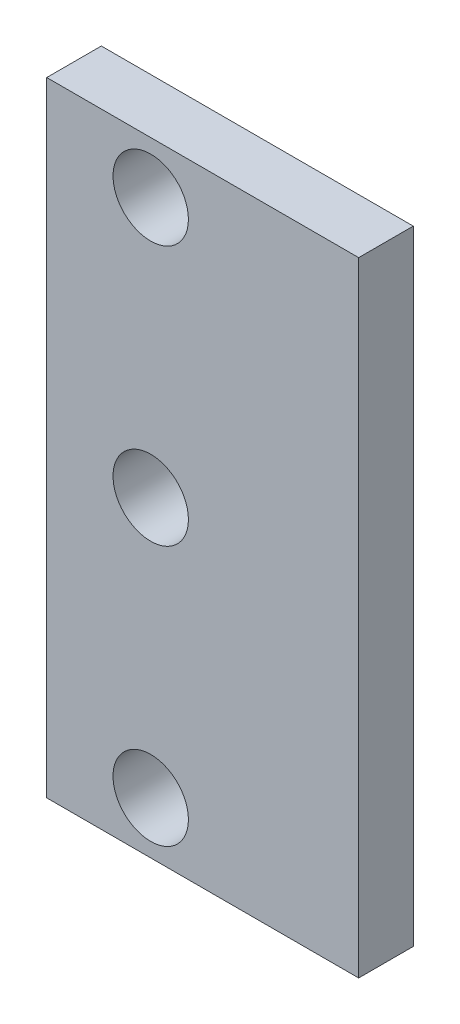
ISO-10303-21;
HEADER;
FILE_DESCRIPTION(('STEP AP214'),'2;1');
FILE_NAME('part.step','',(''),(''),'','','');
FILE_SCHEMA(('AUTOMOTIVE_DESIGN { 1 0 10303 214 1 1 1 1 }'));
ENDSEC;
DATA;
#1=APPLICATION_CONTEXT('core data for automotive mechanical design processes');
#2=APPLICATION_PROTOCOL_DEFINITION('international standard','automotive_design',2000,#1);
#3=PRODUCT_CONTEXT('',#1,'mechanical');
#4=PRODUCT('Part','Part','',(#3));
#5=PRODUCT_RELATED_PRODUCT_CATEGORY('part','',(#4));
#6=PRODUCT_DEFINITION_FORMATION('','',#4);
#7=PRODUCT_DEFINITION_CONTEXT('part definition',#1,'design');
#8=PRODUCT_DEFINITION('design','',#6,#7);
#9=PRODUCT_DEFINITION_SHAPE('','',#8);
#10=(LENGTH_UNIT() NAMED_UNIT(*) SI_UNIT(.MILLI.,.METRE.));
#11=(NAMED_UNIT(*) PLANE_ANGLE_UNIT() SI_UNIT($,.RADIAN.));
#12=(NAMED_UNIT(*) SI_UNIT($,.STERADIAN.) SOLID_ANGLE_UNIT());
#13=UNCERTAINTY_MEASURE_WITH_UNIT(LENGTH_MEASURE(1.E-05),#10,'distance_accuracy_value','');
#14=(GEOMETRIC_REPRESENTATION_CONTEXT(3) GLOBAL_UNCERTAINTY_ASSIGNED_CONTEXT((#13)) GLOBAL_UNIT_ASSIGNED_CONTEXT((#10,
#11,#12)) REPRESENTATION_CONTEXT('',''));
#15=CARTESIAN_POINT('',(0.,0.,0.));
#16=DIRECTION('',(0.,0.,1.));
#17=DIRECTION('',(1.,0.,0.));
#18=AXIS2_PLACEMENT_3D('',#15,#16,#17);
#19=CARTESIAN_POINT('',(0.,0.,5.25));
#20=DIRECTION('',(0.,0.,1.));
#21=DIRECTION('',(1.,0.,0.));
#22=AXIS2_PLACEMENT_3D('',#19,#20,#21);
#23=PLANE('',#22);
#24=CARTESIAN_POINT('',(-5.,0.,5.25));
#25=DIRECTION('',(0.,0.,1.));
#26=DIRECTION('',(1.,0.,0.));
#27=AXIS2_PLACEMENT_3D('',#24,#25,#26);
#28=CIRCLE('',#27,3.625);
#29=CARTESIAN_POINT('',(-1.375,0.,5.25));
#30=VERTEX_POINT('',#29);
#31=EDGE_CURVE('E115',#30,#30,#28,.T.);
#32=ORIENTED_EDGE('',*,*,#31,.F.);
#33=EDGE_LOOP('',(#32));
#34=FACE_BOUND('',#33,.T.);
#35=DIRECTION('',(0.,-1.,0.));
#36=VECTOR('',#35,1.);
#37=CARTESIAN_POINT('',(-15.,-30.,5.25));
#38=LINE('',#37,#36);
#39=CARTESIAN_POINT('',(-15.,30.,5.25));
#40=VERTEX_POINT('',#39);
#41=CARTESIAN_POINT('',(-15.,-30.,5.25));
#42=VERTEX_POINT('',#41);
#43=EDGE_CURVE('E85',#40,#42,#38,.T.);
#44=ORIENTED_EDGE('',*,*,#43,.T.);
#45=DIRECTION('',(1.,0.,0.));
#46=VECTOR('',#45,1.);
#47=CARTESIAN_POINT('',(15.,-30.,5.25));
#48=LINE('',#47,#46);
#49=CARTESIAN_POINT('',(15.,-30.,5.25));
#50=VERTEX_POINT('',#49);
#51=EDGE_CURVE('E80',#42,#50,#48,.T.);
#52=ORIENTED_EDGE('',*,*,#51,.T.);
#53=DIRECTION('',(0.,1.,0.));
#54=VECTOR('',#53,1.);
#55=CARTESIAN_POINT('',(15.,-30.,5.25));
#56=LINE('',#55,#54);
#57=CARTESIAN_POINT('',(15.,30.,5.25));
#58=VERTEX_POINT('',#57);
#59=EDGE_CURVE('E83',#50,#58,#56,.T.);
#60=ORIENTED_EDGE('',*,*,#59,.T.);
#61=DIRECTION('',(-1.,0.,0.));
#62=VECTOR('',#61,1.);
#63=CARTESIAN_POINT('',(15.,30.,5.25));
#64=LINE('',#63,#62);
#65=EDGE_CURVE('E50',#58,#40,#64,.T.);
#66=ORIENTED_EDGE('',*,*,#65,.T.);
#67=EDGE_LOOP('',(#44,#52,#60,#66));
#68=FACE_BOUND('',#67,.T.);
#69=CARTESIAN_POINT('',(-5.,25.,5.25));
#70=DIRECTION('',(0.,0.,1.));
#71=DIRECTION('',(1.,0.,0.));
#72=AXIS2_PLACEMENT_3D('',#69,#70,#71);
#73=CIRCLE('',#72,3.625);
#74=CARTESIAN_POINT('',(-1.375,25.,5.25));
#75=VERTEX_POINT('',#74);
#76=EDGE_CURVE('E100',#75,#75,#73,.T.);
#77=ORIENTED_EDGE('',*,*,#76,.F.);
#78=EDGE_LOOP('',(#77));
#79=FACE_BOUND('',#78,.T.);
#80=CARTESIAN_POINT('',(-5.,-25.,5.25));
#81=DIRECTION('',(0.,0.,1.));
#82=DIRECTION('',(1.,0.,0.));
#83=AXIS2_PLACEMENT_3D('',#80,#81,#82);
#84=CIRCLE('',#83,3.625);
#85=CARTESIAN_POINT('',(-1.375,-25.,5.25));
#86=VERTEX_POINT('',#85);
#87=EDGE_CURVE('E121',#86,#86,#84,.T.);
#88=ORIENTED_EDGE('',*,*,#87,.F.);
#89=EDGE_LOOP('',(#88));
#90=FACE_BOUND('',#89,.T.);
#91=ADVANCED_FACE('F33',(#34,#68,#79,#90),#23,.T.);
#92=CARTESIAN_POINT('',(0.,0.,0.));
#93=DIRECTION('',(0.,0.,1.));
#94=DIRECTION('',(1.,0.,0.));
#95=AXIS2_PLACEMENT_3D('',#92,#93,#94);
#96=PLANE('',#95);
#97=DIRECTION('',(0.,-1.,0.));
#98=VECTOR('',#97,1.);
#99=CARTESIAN_POINT('',(-15.,-30.,0.));
#100=LINE('',#99,#98);
#101=CARTESIAN_POINT('',(-15.,30.,0.));
#102=VERTEX_POINT('',#101);
#103=CARTESIAN_POINT('',(-15.,-30.,0.));
#104=VERTEX_POINT('',#103);
#105=EDGE_CURVE('E97',#102,#104,#100,.T.);
#106=ORIENTED_EDGE('',*,*,#105,.F.);
#107=DIRECTION('',(-1.,0.,0.));
#108=VECTOR('',#107,1.);
#109=CARTESIAN_POINT('',(15.,30.,0.));
#110=LINE('',#109,#108);
#111=CARTESIAN_POINT('',(15.,30.,0.));
#112=VERTEX_POINT('',#111);
#113=EDGE_CURVE('E73',#112,#102,#110,.T.);
#114=ORIENTED_EDGE('',*,*,#113,.F.);
#115=DIRECTION('',(0.,1.,0.));
#116=VECTOR('',#115,1.);
#117=CARTESIAN_POINT('',(15.,-30.,0.));
#118=LINE('',#117,#116);
#119=CARTESIAN_POINT('',(15.,-30.,0.));
#120=VERTEX_POINT('',#119);
#121=EDGE_CURVE('E67',#120,#112,#118,.T.);
#122=ORIENTED_EDGE('',*,*,#121,.F.);
#123=DIRECTION('',(1.,0.,0.));
#124=VECTOR('',#123,1.);
#125=CARTESIAN_POINT('',(15.,-30.,0.));
#126=LINE('',#125,#124);
#127=EDGE_CURVE('E89',#104,#120,#126,.T.);
#128=ORIENTED_EDGE('',*,*,#127,.F.);
#129=EDGE_LOOP('',(#106,#114,#122,#128));
#130=FACE_BOUND('',#129,.T.);
#131=CARTESIAN_POINT('',(-5.,25.,0.));
#132=DIRECTION('',(0.,0.,1.));
#133=DIRECTION('',(1.,0.,0.));
#134=AXIS2_PLACEMENT_3D('',#131,#132,#133);
#135=CIRCLE('',#134,3.625);
#136=CARTESIAN_POINT('',(-1.375,25.,0.));
#137=VERTEX_POINT('',#136);
#138=EDGE_CURVE('E112',#137,#137,#135,.T.);
#139=ORIENTED_EDGE('',*,*,#138,.T.);
#140=EDGE_LOOP('',(#139));
#141=FACE_BOUND('',#140,.T.);
#142=CARTESIAN_POINT('',(-5.,0.,0.));
#143=DIRECTION('',(0.,0.,1.));
#144=DIRECTION('',(1.,0.,0.));
#145=AXIS2_PLACEMENT_3D('',#142,#143,#144);
#146=CIRCLE('',#145,3.625);
#147=CARTESIAN_POINT('',(-1.375,0.,0.));
#148=VERTEX_POINT('',#147);
#149=EDGE_CURVE('E118',#148,#148,#146,.T.);
#150=ORIENTED_EDGE('',*,*,#149,.T.);
#151=EDGE_LOOP('',(#150));
#152=FACE_BOUND('',#151,.T.);
#153=CARTESIAN_POINT('',(-5.,-25.,0.));
#154=DIRECTION('',(0.,0.,1.));
#155=DIRECTION('',(1.,0.,0.));
#156=AXIS2_PLACEMENT_3D('',#153,#154,#155);
#157=CIRCLE('',#156,3.625);
#158=CARTESIAN_POINT('',(-1.375,-25.,0.));
#159=VERTEX_POINT('',#158);
#160=EDGE_CURVE('E124',#159,#159,#157,.T.);
#161=ORIENTED_EDGE('',*,*,#160,.T.);
#162=EDGE_LOOP('',(#161));
#163=FACE_BOUND('',#162,.T.);
#164=ADVANCED_FACE('F108',(#130,#141,#152,#163),#96,.F.);
#165=CARTESIAN_POINT('',(-15.,-30.,5.25));
#166=DIRECTION('',(1.,0.,0.));
#167=DIRECTION('',(0.,0.,-1.));
#168=AXIS2_PLACEMENT_3D('',#165,#166,#167);
#169=PLANE('',#168);
#170=ORIENTED_EDGE('',*,*,#105,.T.);
#171=DIRECTION('',(0.,0.,-1.));
#172=VECTOR('',#171,1.);
#173=CARTESIAN_POINT('',(-15.,-30.,5.25));
#174=LINE('',#173,#172);
#175=EDGE_CURVE('E11',#42,#104,#174,.T.);
#176=ORIENTED_EDGE('',*,*,#175,.F.);
#177=ORIENTED_EDGE('',*,*,#43,.F.);
#178=DIRECTION('',(0.,0.,-1.));
#179=VECTOR('',#178,1.);
#180=CARTESIAN_POINT('',(-15.,30.,5.25));
#181=LINE('',#180,#179);
#182=EDGE_CURVE('E93',#40,#102,#181,.T.);
#183=ORIENTED_EDGE('',*,*,#182,.T.);
#184=EDGE_LOOP('',(#170,#176,#177,#183));
#185=FACE_BOUND('',#184,.T.);
#186=ADVANCED_FACE('F35',(#185),#169,.F.);
#187=CARTESIAN_POINT('',(15.,-30.,5.25));
#188=DIRECTION('',(0.,1.,0.));
#189=DIRECTION('',(0.,0.,1.));
#190=AXIS2_PLACEMENT_3D('',#187,#188,#189);
#191=PLANE('',#190);
#192=ORIENTED_EDGE('',*,*,#127,.T.);
#193=DIRECTION('',(0.,0.,-1.));
#194=VECTOR('',#193,1.);
#195=CARTESIAN_POINT('',(15.,-30.,5.25));
#196=LINE('',#195,#194);
#197=EDGE_CURVE('E42',#50,#120,#196,.T.);
#198=ORIENTED_EDGE('',*,*,#197,.F.);
#199=ORIENTED_EDGE('',*,*,#51,.F.);
#200=ORIENTED_EDGE('',*,*,#175,.T.);
#201=EDGE_LOOP('',(#192,#198,#199,#200));
#202=FACE_BOUND('',#201,.T.);
#203=ADVANCED_FACE('F88',(#202),#191,.F.);
#204=CARTESIAN_POINT('',(15.,-30.,5.25));
#205=DIRECTION('',(-1.,0.,0.));
#206=DIRECTION('',(0.,0.,1.));
#207=AXIS2_PLACEMENT_3D('',#204,#205,#206);
#208=PLANE('',#207);
#209=ORIENTED_EDGE('',*,*,#121,.T.);
#210=DIRECTION('',(0.,0.,-1.));
#211=VECTOR('',#210,1.);
#212=CARTESIAN_POINT('',(15.,30.,5.25));
#213=LINE('',#212,#211);
#214=EDGE_CURVE('E90',#58,#112,#213,.T.);
#215=ORIENTED_EDGE('',*,*,#214,.F.);
#216=ORIENTED_EDGE('',*,*,#59,.F.);
#217=ORIENTED_EDGE('',*,*,#197,.T.);
#218=EDGE_LOOP('',(#209,#215,#216,#217));
#219=FACE_BOUND('',#218,.T.);
#220=ADVANCED_FACE('F91',(#219),#208,.F.);
#221=CARTESIAN_POINT('',(15.,30.,5.25));
#222=DIRECTION('',(0.,-1.,0.));
#223=DIRECTION('',(0.,0.,-1.));
#224=AXIS2_PLACEMENT_3D('',#221,#222,#223);
#225=PLANE('',#224);
#226=ORIENTED_EDGE('',*,*,#113,.T.);
#227=ORIENTED_EDGE('',*,*,#182,.F.);
#228=ORIENTED_EDGE('',*,*,#65,.F.);
#229=ORIENTED_EDGE('',*,*,#214,.T.);
#230=EDGE_LOOP('',(#226,#227,#228,#229));
#231=FACE_BOUND('',#230,.T.);
#232=ADVANCED_FACE('F105',(#231),#225,.F.);
#233=CARTESIAN_POINT('',(-5.,25.,5.25));
#234=DIRECTION('',(0.,0.,-1.));
#235=DIRECTION('',(-1.,0.,0.));
#236=AXIS2_PLACEMENT_3D('',#233,#234,#235);
#237=CYLINDRICAL_SURFACE('',#236,3.625);
#238=ORIENTED_EDGE('',*,*,#76,.T.);
#239=EDGE_LOOP('',(#238));
#240=FACE_BOUND('',#239,.T.);
#241=ORIENTED_EDGE('',*,*,#138,.F.);
#242=EDGE_LOOP('',(#241));
#243=FACE_BOUND('',#242,.T.);
#244=ADVANCED_FACE('F142',(#240,#243),#237,.F.);
#245=CARTESIAN_POINT('',(-5.,0.,5.25));
#246=DIRECTION('',(0.,0.,-1.));
#247=DIRECTION('',(-1.,0.,0.));
#248=AXIS2_PLACEMENT_3D('',#245,#246,#247);
#249=CYLINDRICAL_SURFACE('',#248,3.625);
#250=ORIENTED_EDGE('',*,*,#31,.T.);
#251=EDGE_LOOP('',(#250));
#252=FACE_BOUND('',#251,.T.);
#253=ORIENTED_EDGE('',*,*,#149,.F.);
#254=EDGE_LOOP('',(#253));
#255=FACE_BOUND('',#254,.T.);
#256=ADVANCED_FACE('F188',(#252,#255),#249,.F.);
#257=CARTESIAN_POINT('',(-5.,-25.,5.25));
#258=DIRECTION('',(0.,0.,-1.));
#259=DIRECTION('',(-1.,0.,0.));
#260=AXIS2_PLACEMENT_3D('',#257,#258,#259);
#261=CYLINDRICAL_SURFACE('',#260,3.625);
#262=ORIENTED_EDGE('',*,*,#87,.T.);
#263=EDGE_LOOP('',(#262));
#264=FACE_BOUND('',#263,.T.);
#265=ORIENTED_EDGE('',*,*,#160,.F.);
#266=EDGE_LOOP('',(#265));
#267=FACE_BOUND('',#266,.T.);
#268=ADVANCED_FACE('F130',(#264,#267),#261,.F.);
#269=CLOSED_SHELL('',(#91,#164,#186,#203,#220,#232,#244,#256,#268));
#270=MANIFOLD_SOLID_BREP('B2',#269);
#271=ADVANCED_BREP_SHAPE_REPRESENTATION('',(#18,#270),#14);
#272=SHAPE_DEFINITION_REPRESENTATION(#9,#271);
ENDSEC;
END-ISO-10303-21;
